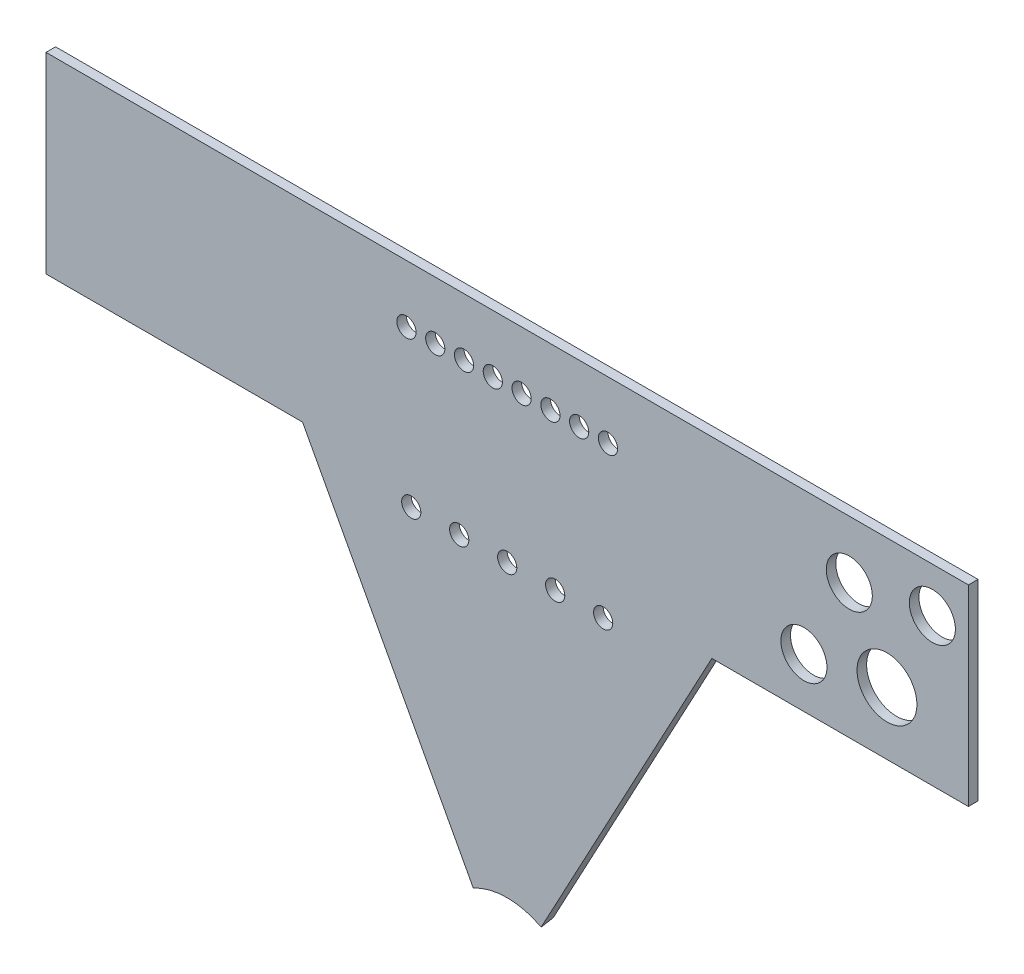
ISO-10303-21;
HEADER;
FILE_DESCRIPTION(('STEP AP214'),'2;1');
FILE_NAME('part.step','',(''),(''),'','','');
FILE_SCHEMA(('AUTOMOTIVE_DESIGN { 1 0 10303 214 1 1 1 1 }'));
ENDSEC;
DATA;
#1=APPLICATION_CONTEXT('core data for automotive mechanical design processes');
#2=APPLICATION_PROTOCOL_DEFINITION('international standard','automotive_design',2000,#1);
#3=PRODUCT_CONTEXT('',#1,'mechanical');
#4=PRODUCT('Part','Part','',(#3));
#5=PRODUCT_RELATED_PRODUCT_CATEGORY('part','',(#4));
#6=PRODUCT_DEFINITION_FORMATION('','',#4);
#7=PRODUCT_DEFINITION_CONTEXT('part definition',#1,'design');
#8=PRODUCT_DEFINITION('design','',#6,#7);
#9=PRODUCT_DEFINITION_SHAPE('','',#8);
#10=(LENGTH_UNIT() NAMED_UNIT(*) SI_UNIT(.MILLI.,.METRE.));
#11=(NAMED_UNIT(*) PLANE_ANGLE_UNIT() SI_UNIT($,.RADIAN.));
#12=(NAMED_UNIT(*) SI_UNIT($,.STERADIAN.) SOLID_ANGLE_UNIT());
#13=UNCERTAINTY_MEASURE_WITH_UNIT(LENGTH_MEASURE(1.E-05),#10,'distance_accuracy_value','');
#14=(GEOMETRIC_REPRESENTATION_CONTEXT(3) GLOBAL_UNCERTAINTY_ASSIGNED_CONTEXT((#13)) GLOBAL_UNIT_ASSIGNED_CONTEXT((#10,
#11,#12)) REPRESENTATION_CONTEXT('',''));
#15=CARTESIAN_POINT('',(0.,0.,0.));
#16=DIRECTION('',(0.,0.,1.));
#17=DIRECTION('',(1.,0.,0.));
#18=AXIS2_PLACEMENT_3D('',#15,#16,#17);
#19=CARTESIAN_POINT('',(0.,-189.675350303477,0.));
#20=DIRECTION('',(0.,0.,-1.));
#21=DIRECTION('',(-1.,0.,0.));
#22=AXIS2_PLACEMENT_3D('',#19,#20,#21);
#23=CONICAL_SURFACE('',#22,25.441249351152,0.488692190558413);
#24=DIRECTION('',(-0.221981139159225,0.413676107748804,-0.882947592858927));
#25=VECTOR('',#24,1.);
#26=CARTESIAN_POINT('',(0.,-189.675350303477,47.8480309661866));
#27=LINE('',#26,#25);
#28=CARTESIAN_POINT('',(-12.0294347097189,-167.257726229724,0.));
#29=VERTEX_POINT('',#28);
#30=CARTESIAN_POINT('',(-11.2312105313751,-168.745268245496,3.175));
#31=VERTEX_POINT('',#30);
#32=EDGE_CURVE('E254',#29,#31,#27,.F.);
#33=ORIENTED_EDGE('',*,*,#32,.F.);
#34=CARTESIAN_POINT('',(0.,-189.675350303477,0.));
#35=DIRECTION('',(0.,0.,-1.));
#36=DIRECTION('',(-1.,0.,0.));
#37=AXIS2_PLACEMENT_3D('',#34,#35,#36);
#38=CIRCLE('',#37,25.441249351152);
#39=CARTESIAN_POINT('',(12.0294347097191,-167.257726229724,0.));
#40=VERTEX_POINT('',#39);
#41=EDGE_CURVE('E113',#29,#40,#38,.T.);
#42=ORIENTED_EDGE('',*,*,#41,.T.);
#43=DIRECTION('',(0.221981139159225,0.413676107748804,-0.882947592858926));
#44=VECTOR('',#43,1.);
#45=CARTESIAN_POINT('',(1.710275213163E-13,-189.675350303477,47.8480309661866));
#46=LINE('',#45,#44);
#47=CARTESIAN_POINT('',(11.2312105313752,-168.745268245496,3.175));
#48=VERTEX_POINT('',#47);
#49=EDGE_CURVE('E245',#40,#48,#46,.F.);
#50=ORIENTED_EDGE('',*,*,#49,.T.);
#51=CARTESIAN_POINT('',(0.,-189.675350303477,3.175));
#52=DIRECTION('',(0.,0.,-1.));
#53=DIRECTION('',(-1.,0.,0.));
#54=AXIS2_PLACEMENT_3D('',#51,#52,#53);
#55=CIRCLE('',#54,23.7530719056268);
#56=EDGE_CURVE('E12',#31,#48,#55,.T.);
#57=ORIENTED_EDGE('',*,*,#56,.F.);
#58=EDGE_LOOP('',(#33,#42,#50,#57));
#59=FACE_BOUND('',#58,.T.);
#60=ADVANCED_FACE('F105',(#59),#23,.F.);
#61=CARTESIAN_POINT('',(0.,-189.675350303477,3.175));
#62=DIRECTION('',(0.,0.,-1.));
#63=DIRECTION('',(-1.,0.,0.));
#64=AXIS2_PLACEMENT_3D('',#61,#62,#63);
#65=PLANE('',#64);
#66=CARTESIAN_POINT('',(-31.75,-69.85,3.175));
#67=DIRECTION('',(0.,0.,1.));
#68=DIRECTION('',(1.,0.,0.));
#69=AXIS2_PLACEMENT_3D('',#66,#67,#68);
#70=CIRCLE('',#69,3.17499999999999);
#71=CARTESIAN_POINT('',(-28.575,-69.85,3.175));
#72=VERTEX_POINT('',#71);
#73=EDGE_CURVE('E617',#72,#72,#70,.T.);
#74=ORIENTED_EDGE('',*,*,#73,.F.);
#75=EDGE_LOOP('',(#74));
#76=FACE_BOUND('',#75,.T.);
#77=CARTESIAN_POINT('',(-15.875,-69.85,3.175));
#78=DIRECTION('',(0.,0.,1.));
#79=DIRECTION('',(1.,0.,0.));
#80=AXIS2_PLACEMENT_3D('',#77,#78,#79);
#81=CIRCLE('',#80,3.17499999999999);
#82=CARTESIAN_POINT('',(-12.7,-69.85,3.175));
#83=VERTEX_POINT('',#82);
#84=EDGE_CURVE('E621',#83,#83,#81,.T.);
#85=ORIENTED_EDGE('',*,*,#84,.F.);
#86=EDGE_LOOP('',(#85));
#87=FACE_BOUND('',#86,.T.);
#88=CARTESIAN_POINT('',(0.,-69.85,3.175));
#89=DIRECTION('',(0.,0.,1.));
#90=DIRECTION('',(1.,0.,0.));
#91=AXIS2_PLACEMENT_3D('',#88,#89,#90);
#92=CIRCLE('',#91,3.17499999999999);
#93=CARTESIAN_POINT('',(3.17499999999999,-69.85,3.175));
#94=VERTEX_POINT('',#93);
#95=EDGE_CURVE('E631',#94,#94,#92,.T.);
#96=ORIENTED_EDGE('',*,*,#95,.F.);
#97=EDGE_LOOP('',(#96));
#98=FACE_BOUND('',#97,.T.);
#99=CARTESIAN_POINT('',(15.875,-69.85,3.175));
#100=DIRECTION('',(0.,0.,1.));
#101=DIRECTION('',(1.,0.,0.));
#102=AXIS2_PLACEMENT_3D('',#99,#100,#101);
#103=CIRCLE('',#102,3.17499999999999);
#104=CARTESIAN_POINT('',(19.05,-69.85,3.175));
#105=VERTEX_POINT('',#104);
#106=EDGE_CURVE('E639',#105,#105,#103,.T.);
#107=ORIENTED_EDGE('',*,*,#106,.F.);
#108=EDGE_LOOP('',(#107));
#109=FACE_BOUND('',#108,.T.);
#110=CARTESIAN_POINT('',(31.75,-69.85,3.175));
#111=DIRECTION('',(0.,0.,1.));
#112=DIRECTION('',(1.,0.,0.));
#113=AXIS2_PLACEMENT_3D('',#110,#111,#112);
#114=CIRCLE('',#113,3.17499999999998);
#115=CARTESIAN_POINT('',(34.925,-69.85,3.175));
#116=VERTEX_POINT('',#115);
#117=EDGE_CURVE('E647',#116,#116,#114,.T.);
#118=ORIENTED_EDGE('',*,*,#117,.F.);
#119=EDGE_LOOP('',(#118));
#120=FACE_BOUND('',#119,.T.);
#121=CARTESIAN_POINT('',(98.1656068778571,-47.0265963737712,3.175));
#122=DIRECTION('',(0.,0.,1.));
#123=DIRECTION('',(1.,0.,0.));
#124=AXIS2_PLACEMENT_3D('',#121,#122,#123);
#125=CIRCLE('',#124,7.62);
#126=CARTESIAN_POINT('',(105.785606877857,-47.0265963737712,3.175));
#127=VERTEX_POINT('',#126);
#128=EDGE_CURVE('E673',#127,#127,#125,.T.);
#129=ORIENTED_EDGE('',*,*,#128,.F.);
#130=EDGE_LOOP('',(#129));
#131=FACE_BOUND('',#130,.T.);
#132=CARTESIAN_POINT('',(113.178020252764,-19.05,3.175));
#133=DIRECTION('',(0.,0.,1.));
#134=DIRECTION('',(1.,0.,0.));
#135=AXIS2_PLACEMENT_3D('',#132,#133,#134);
#136=CIRCLE('',#135,7.62);
#137=CARTESIAN_POINT('',(120.798020252764,-19.05,3.175));
#138=VERTEX_POINT('',#137);
#139=EDGE_CURVE('E665',#138,#138,#136,.T.);
#140=ORIENTED_EDGE('',*,*,#139,.F.);
#141=EDGE_LOOP('',(#140));
#142=FACE_BOUND('',#141,.T.);
#143=CARTESIAN_POINT('',(140.652136328267,-14.8542384926758,3.175));
#144=DIRECTION('',(0.,0.,1.));
#145=DIRECTION('',(1.,0.,0.));
#146=AXIS2_PLACEMENT_3D('',#143,#144,#145);
#147=CIRCLE('',#146,7.62);
#148=CARTESIAN_POINT('',(148.272136328267,-14.8542384926758,3.175));
#149=VERTEX_POINT('',#148);
#150=EDGE_CURVE('E656',#149,#149,#147,.T.);
#151=ORIENTED_EDGE('',*,*,#150,.F.);
#152=EDGE_LOOP('',(#151));
#153=FACE_BOUND('',#152,.T.);
#154=CARTESIAN_POINT('',(125.63972295336,-42.8308348664471,3.175));
#155=DIRECTION('',(0.,0.,1.));
#156=DIRECTION('',(1.,0.,0.));
#157=AXIS2_PLACEMENT_3D('',#154,#155,#156);
#158=CIRCLE('',#157,9.90600000000007);
#159=CARTESIAN_POINT('',(135.54572295336,-42.8308348664471,3.175));
#160=VERTEX_POINT('',#159);
#161=EDGE_CURVE('E660',#160,#160,#158,.T.);
#162=ORIENTED_EDGE('',*,*,#161,.F.);
#163=EDGE_LOOP('',(#162));
#164=FACE_BOUND('',#163,.T.);
#165=CARTESIAN_POINT('',(33.3374999999998,-19.0500000000003,3.175));
#166=DIRECTION('',(0.,0.,1.));
#167=DIRECTION('',(1.,0.,0.));
#168=AXIS2_PLACEMENT_3D('',#165,#166,#167);
#169=CIRCLE('',#168,3.175);
#170=CARTESIAN_POINT('',(36.5124999999998,-19.0500000000003,3.175));
#171=VERTEX_POINT('',#170);
#172=EDGE_CURVE('E684',#171,#171,#169,.T.);
#173=ORIENTED_EDGE('',*,*,#172,.F.);
#174=EDGE_LOOP('',(#173));
#175=FACE_BOUND('',#174,.T.);
#176=CARTESIAN_POINT('',(23.8124999999998,-19.0500000000002,3.175));
#177=DIRECTION('',(0.,0.,1.));
#178=DIRECTION('',(1.,0.,0.));
#179=AXIS2_PLACEMENT_3D('',#176,#177,#178);
#180=CIRCLE('',#179,3.175);
#181=CARTESIAN_POINT('',(26.9874999999998,-19.0500000000002,3.175));
#182=VERTEX_POINT('',#181);
#183=EDGE_CURVE('E695',#182,#182,#180,.T.);
#184=ORIENTED_EDGE('',*,*,#183,.F.);
#185=EDGE_LOOP('',(#184));
#186=FACE_BOUND('',#185,.T.);
#187=CARTESIAN_POINT('',(14.2874999999998,-19.0500000000001,3.175));
#188=DIRECTION('',(0.,0.,1.));
#189=DIRECTION('',(1.,0.,0.));
#190=AXIS2_PLACEMENT_3D('',#187,#188,#189);
#191=CIRCLE('',#190,3.175);
#192=CARTESIAN_POINT('',(17.4624999999998,-19.0500000000001,3.175));
#193=VERTEX_POINT('',#192);
#194=EDGE_CURVE('E703',#193,#193,#191,.T.);
#195=ORIENTED_EDGE('',*,*,#194,.F.);
#196=EDGE_LOOP('',(#195));
#197=FACE_BOUND('',#196,.T.);
#198=CARTESIAN_POINT('',(4.76249999999985,-19.05,3.175));
#199=DIRECTION('',(0.,0.,1.));
#200=DIRECTION('',(1.,0.,0.));
#201=AXIS2_PLACEMENT_3D('',#198,#199,#200);
#202=CIRCLE('',#201,3.175);
#203=CARTESIAN_POINT('',(7.93749999999985,-19.05,3.175));
#204=VERTEX_POINT('',#203);
#205=EDGE_CURVE('E711',#204,#204,#202,.T.);
#206=ORIENTED_EDGE('',*,*,#205,.F.);
#207=EDGE_LOOP('',(#206));
#208=FACE_BOUND('',#207,.T.);
#209=CARTESIAN_POINT('',(-33.3375,-19.05,3.175));
#210=DIRECTION('',(0.,0.,1.));
#211=DIRECTION('',(1.,0.,0.));
#212=AXIS2_PLACEMENT_3D('',#209,#210,#211);
#213=CIRCLE('',#212,3.175);
#214=CARTESIAN_POINT('',(-30.1625,-19.05,3.175));
#215=VERTEX_POINT('',#214);
#216=EDGE_CURVE('E719',#215,#215,#213,.T.);
#217=ORIENTED_EDGE('',*,*,#216,.F.);
#218=EDGE_LOOP('',(#217));
#219=FACE_BOUND('',#218,.T.);
#220=CARTESIAN_POINT('',(-23.8125,-19.05,3.175));
#221=DIRECTION('',(0.,0.,1.));
#222=DIRECTION('',(1.,0.,0.));
#223=AXIS2_PLACEMENT_3D('',#220,#221,#222);
#224=CIRCLE('',#223,3.175);
#225=CARTESIAN_POINT('',(-20.6375,-19.05,3.175));
#226=VERTEX_POINT('',#225);
#227=EDGE_CURVE('E727',#226,#226,#224,.T.);
#228=ORIENTED_EDGE('',*,*,#227,.F.);
#229=EDGE_LOOP('',(#228));
#230=FACE_BOUND('',#229,.T.);
#231=CARTESIAN_POINT('',(-14.2875,-19.05,3.175));
#232=DIRECTION('',(0.,0.,1.));
#233=DIRECTION('',(1.,0.,0.));
#234=AXIS2_PLACEMENT_3D('',#231,#232,#233);
#235=CIRCLE('',#234,3.175);
#236=CARTESIAN_POINT('',(-11.1125,-19.05,3.175));
#237=VERTEX_POINT('',#236);
#238=EDGE_CURVE('E735',#237,#237,#235,.T.);
#239=ORIENTED_EDGE('',*,*,#238,.F.);
#240=EDGE_LOOP('',(#239));
#241=FACE_BOUND('',#240,.T.);
#242=CARTESIAN_POINT('',(-4.7625,-19.05,3.175));
#243=DIRECTION('',(0.,0.,1.));
#244=DIRECTION('',(1.,0.,0.));
#245=AXIS2_PLACEMENT_3D('',#242,#243,#244);
#246=CIRCLE('',#245,3.175);
#247=CARTESIAN_POINT('',(-1.5875,-19.05,3.175));
#248=VERTEX_POINT('',#247);
#249=EDGE_CURVE('E203',#248,#248,#246,.T.);
#250=ORIENTED_EDGE('',*,*,#249,.F.);
#251=EDGE_LOOP('',(#250));
#252=FACE_BOUND('',#251,.T.);
#253=DIRECTION('',(1.,0.,0.));
#254=VECTOR('',#253,1.);
#255=CARTESIAN_POINT('',(101.780957474,0.,3.175));
#256=LINE('',#255,#254);
#257=CARTESIAN_POINT('',(-152.580957474,0.,3.175));
#258=VERTEX_POINT('',#257);
#259=CARTESIAN_POINT('',(152.580957474,0.,3.175));
#260=VERTEX_POINT('',#259);
#261=EDGE_CURVE('E197',#258,#260,#256,.T.);
#262=ORIENTED_EDGE('',*,*,#261,.F.);
#263=DIRECTION('',(0.,-1.,0.));
#264=VECTOR('',#263,1.);
#265=CARTESIAN_POINT('',(-152.580957474,0.,3.175));
#266=LINE('',#265,#264);
#267=CARTESIAN_POINT('',(-152.580957474,-63.5,3.175));
#268=VERTEX_POINT('',#267);
#269=EDGE_CURVE('E218',#258,#268,#266,.T.);
#270=ORIENTED_EDGE('',*,*,#269,.T.);
#271=DIRECTION('',(1.,0.,0.));
#272=VECTOR('',#271,1.);
#273=CARTESIAN_POINT('',(-152.580957474,-63.5,3.175));
#274=LINE('',#273,#272);
#275=CARTESIAN_POINT('',(-67.7064676193184,-63.5,3.175));
#276=VERTEX_POINT('',#275);
#277=EDGE_CURVE('E221',#268,#276,#274,.T.);
#278=ORIENTED_EDGE('',*,*,#277,.T.);
#279=DIRECTION('',(0.472831917319904,-0.881152641693585,0.));
#280=VECTOR('',#279,1.);
#281=CARTESIAN_POINT('',(-79.0257865686502,-42.4057222471134,3.175));
#282=LINE('',#281,#280);
#283=EDGE_CURVE('E242',#276,#31,#282,.T.);
#284=ORIENTED_EDGE('',*,*,#283,.T.);
#285=ORIENTED_EDGE('',*,*,#56,.T.);
#286=DIRECTION('',(-0.472831917319904,-0.881152641693585,0.));
#287=VECTOR('',#286,1.);
#288=CARTESIAN_POINT('',(79.0257865686503,-42.4057222471134,3.175));
#289=LINE('',#288,#287);
#290=CARTESIAN_POINT('',(67.7064676193185,-63.5,3.175));
#291=VERTEX_POINT('',#290);
#292=EDGE_CURVE('E246',#291,#48,#289,.T.);
#293=ORIENTED_EDGE('',*,*,#292,.F.);
#294=DIRECTION('',(1.,0.,0.));
#295=VECTOR('',#294,1.);
#296=CARTESIAN_POINT('',(152.580957474,-63.5,3.175));
#297=LINE('',#296,#295);
#298=CARTESIAN_POINT('',(152.580957474,-63.5,3.175));
#299=VERTEX_POINT('',#298);
#300=EDGE_CURVE('E120',#291,#299,#297,.T.);
#301=ORIENTED_EDGE('',*,*,#300,.T.);
#302=DIRECTION('',(0.,1.,0.));
#303=VECTOR('',#302,1.);
#304=CARTESIAN_POINT('',(152.580957474,0.,3.175));
#305=LINE('',#304,#303);
#306=EDGE_CURVE('E215',#299,#260,#305,.T.);
#307=ORIENTED_EDGE('',*,*,#306,.T.);
#308=EDGE_LOOP('',(#262,#270,#278,#284,#285,#293,#301,#307));
#309=FACE_BOUND('',#308,.T.);
#310=ADVANCED_FACE('F272',(#76,#87,#98,#109,#120,#131,#142,#153,#164,#175,#186,#197,#208,#219,
#230,#241,#252,#309),#65,.F.);
#311=CARTESIAN_POINT('',(0.,-189.675350303477,0.));
#312=DIRECTION('',(0.,0.,-1.));
#313=DIRECTION('',(-1.,0.,0.));
#314=AXIS2_PLACEMENT_3D('',#311,#312,#313);
#315=PLANE('',#314);
#316=CARTESIAN_POINT('',(-31.75,-69.85,0.));
#317=DIRECTION('',(0.,0.,1.));
#318=DIRECTION('',(1.,0.,0.));
#319=AXIS2_PLACEMENT_3D('',#316,#317,#318);
#320=CIRCLE('',#319,3.175);
#321=CARTESIAN_POINT('',(-28.575,-69.85,0.));
#322=VERTEX_POINT('',#321);
#323=EDGE_CURVE('E615',#322,#322,#320,.T.);
#324=ORIENTED_EDGE('',*,*,#323,.T.);
#325=EDGE_LOOP('',(#324));
#326=FACE_BOUND('',#325,.T.);
#327=CARTESIAN_POINT('',(-15.875,-69.85,0.));
#328=DIRECTION('',(0.,0.,1.));
#329=DIRECTION('',(1.,0.,0.));
#330=AXIS2_PLACEMENT_3D('',#327,#328,#329);
#331=CIRCLE('',#330,3.175);
#332=CARTESIAN_POINT('',(-12.7,-69.85,0.));
#333=VERTEX_POINT('',#332);
#334=EDGE_CURVE('E627',#333,#333,#331,.T.);
#335=ORIENTED_EDGE('',*,*,#334,.T.);
#336=EDGE_LOOP('',(#335));
#337=FACE_BOUND('',#336,.T.);
#338=CARTESIAN_POINT('',(0.,-69.85,0.));
#339=DIRECTION('',(0.,0.,1.));
#340=DIRECTION('',(1.,0.,0.));
#341=AXIS2_PLACEMENT_3D('',#338,#339,#340);
#342=CIRCLE('',#341,3.175);
#343=CARTESIAN_POINT('',(3.175,-69.85,0.));
#344=VERTEX_POINT('',#343);
#345=EDGE_CURVE('E635',#344,#344,#342,.T.);
#346=ORIENTED_EDGE('',*,*,#345,.T.);
#347=EDGE_LOOP('',(#346));
#348=FACE_BOUND('',#347,.T.);
#349=CARTESIAN_POINT('',(15.875,-69.85,0.));
#350=DIRECTION('',(0.,0.,1.));
#351=DIRECTION('',(1.,0.,0.));
#352=AXIS2_PLACEMENT_3D('',#349,#350,#351);
#353=CIRCLE('',#352,3.175);
#354=CARTESIAN_POINT('',(19.05,-69.85,0.));
#355=VERTEX_POINT('',#354);
#356=EDGE_CURVE('E643',#355,#355,#353,.T.);
#357=ORIENTED_EDGE('',*,*,#356,.T.);
#358=EDGE_LOOP('',(#357));
#359=FACE_BOUND('',#358,.T.);
#360=CARTESIAN_POINT('',(31.75,-69.85,0.));
#361=DIRECTION('',(0.,0.,1.));
#362=DIRECTION('',(1.,0.,0.));
#363=AXIS2_PLACEMENT_3D('',#360,#361,#362);
#364=CIRCLE('',#363,3.175);
#365=CARTESIAN_POINT('',(34.925,-69.85,0.));
#366=VERTEX_POINT('',#365);
#367=EDGE_CURVE('E651',#366,#366,#364,.T.);
#368=ORIENTED_EDGE('',*,*,#367,.T.);
#369=EDGE_LOOP('',(#368));
#370=FACE_BOUND('',#369,.T.);
#371=CARTESIAN_POINT('',(98.1656068778571,-47.0265963737712,0.));
#372=DIRECTION('',(0.,0.,1.));
#373=DIRECTION('',(1.,0.,0.));
#374=AXIS2_PLACEMENT_3D('',#371,#372,#373);
#375=CIRCLE('',#374,7.62);
#376=CARTESIAN_POINT('',(105.785606877857,-47.0265963737712,0.));
#377=VERTEX_POINT('',#376);
#378=EDGE_CURVE('E655',#377,#377,#375,.T.);
#379=ORIENTED_EDGE('',*,*,#378,.T.);
#380=EDGE_LOOP('',(#379));
#381=FACE_BOUND('',#380,.T.);
#382=CARTESIAN_POINT('',(113.178020252764,-19.05,0.));
#383=DIRECTION('',(0.,0.,1.));
#384=DIRECTION('',(1.,0.,0.));
#385=AXIS2_PLACEMENT_3D('',#382,#383,#384);
#386=CIRCLE('',#385,7.62);
#387=CARTESIAN_POINT('',(120.798020252764,-19.05,0.));
#388=VERTEX_POINT('',#387);
#389=EDGE_CURVE('E669',#388,#388,#386,.T.);
#390=ORIENTED_EDGE('',*,*,#389,.T.);
#391=EDGE_LOOP('',(#390));
#392=FACE_BOUND('',#391,.T.);
#393=CARTESIAN_POINT('',(140.652136328267,-14.8542384926758,0.));
#394=DIRECTION('',(0.,0.,1.));
#395=DIRECTION('',(1.,0.,0.));
#396=AXIS2_PLACEMENT_3D('',#393,#394,#395);
#397=CIRCLE('',#396,7.62);
#398=CARTESIAN_POINT('',(148.272136328267,-14.8542384926758,0.));
#399=VERTEX_POINT('',#398);
#400=EDGE_CURVE('E661',#399,#399,#397,.T.);
#401=ORIENTED_EDGE('',*,*,#400,.T.);
#402=EDGE_LOOP('',(#401));
#403=FACE_BOUND('',#402,.T.);
#404=CARTESIAN_POINT('',(125.63972295336,-42.8308348664471,0.));
#405=DIRECTION('',(0.,0.,1.));
#406=DIRECTION('',(1.,0.,0.));
#407=AXIS2_PLACEMENT_3D('',#404,#405,#406);
#408=CIRCLE('',#407,9.90600000000007);
#409=CARTESIAN_POINT('',(135.54572295336,-42.8308348664471,0.));
#410=VERTEX_POINT('',#409);
#411=EDGE_CURVE('E680',#410,#410,#408,.T.);
#412=ORIENTED_EDGE('',*,*,#411,.T.);
#413=EDGE_LOOP('',(#412));
#414=FACE_BOUND('',#413,.T.);
#415=CARTESIAN_POINT('',(33.3374999999998,-19.0500000000003,0.));
#416=DIRECTION('',(0.,0.,1.));
#417=DIRECTION('',(1.,0.,0.));
#418=AXIS2_PLACEMENT_3D('',#415,#416,#417);
#419=CIRCLE('',#418,3.175);
#420=CARTESIAN_POINT('',(36.5124999999998,-19.0500000000003,0.));
#421=VERTEX_POINT('',#420);
#422=EDGE_CURVE('E691',#421,#421,#419,.T.);
#423=ORIENTED_EDGE('',*,*,#422,.T.);
#424=EDGE_LOOP('',(#423));
#425=FACE_BOUND('',#424,.T.);
#426=CARTESIAN_POINT('',(23.8124999999998,-19.0500000000002,0.));
#427=DIRECTION('',(0.,0.,1.));
#428=DIRECTION('',(1.,0.,0.));
#429=AXIS2_PLACEMENT_3D('',#426,#427,#428);
#430=CIRCLE('',#429,3.175);
#431=CARTESIAN_POINT('',(26.9874999999998,-19.0500000000002,0.));
#432=VERTEX_POINT('',#431);
#433=EDGE_CURVE('E699',#432,#432,#430,.T.);
#434=ORIENTED_EDGE('',*,*,#433,.T.);
#435=EDGE_LOOP('',(#434));
#436=FACE_BOUND('',#435,.T.);
#437=CARTESIAN_POINT('',(14.2874999999998,-19.0500000000001,0.));
#438=DIRECTION('',(0.,0.,1.));
#439=DIRECTION('',(1.,0.,0.));
#440=AXIS2_PLACEMENT_3D('',#437,#438,#439);
#441=CIRCLE('',#440,3.175);
#442=CARTESIAN_POINT('',(17.4624999999998,-19.0500000000001,0.));
#443=VERTEX_POINT('',#442);
#444=EDGE_CURVE('E707',#443,#443,#441,.T.);
#445=ORIENTED_EDGE('',*,*,#444,.T.);
#446=EDGE_LOOP('',(#445));
#447=FACE_BOUND('',#446,.T.);
#448=CARTESIAN_POINT('',(4.76249999999985,-19.05,0.));
#449=DIRECTION('',(0.,0.,1.));
#450=DIRECTION('',(1.,0.,0.));
#451=AXIS2_PLACEMENT_3D('',#448,#449,#450);
#452=CIRCLE('',#451,3.175);
#453=CARTESIAN_POINT('',(7.93749999999985,-19.05,0.));
#454=VERTEX_POINT('',#453);
#455=EDGE_CURVE('E715',#454,#454,#452,.T.);
#456=ORIENTED_EDGE('',*,*,#455,.T.);
#457=EDGE_LOOP('',(#456));
#458=FACE_BOUND('',#457,.T.);
#459=CARTESIAN_POINT('',(-33.3375,-19.05,0.));
#460=DIRECTION('',(0.,0.,1.));
#461=DIRECTION('',(1.,0.,0.));
#462=AXIS2_PLACEMENT_3D('',#459,#460,#461);
#463=CIRCLE('',#462,3.175);
#464=CARTESIAN_POINT('',(-30.1625,-19.05,0.));
#465=VERTEX_POINT('',#464);
#466=EDGE_CURVE('E723',#465,#465,#463,.T.);
#467=ORIENTED_EDGE('',*,*,#466,.T.);
#468=EDGE_LOOP('',(#467));
#469=FACE_BOUND('',#468,.T.);
#470=CARTESIAN_POINT('',(-23.8125,-19.05,0.));
#471=DIRECTION('',(0.,0.,1.));
#472=DIRECTION('',(1.,0.,0.));
#473=AXIS2_PLACEMENT_3D('',#470,#471,#472);
#474=CIRCLE('',#473,3.175);
#475=CARTESIAN_POINT('',(-20.6375,-19.05,0.));
#476=VERTEX_POINT('',#475);
#477=EDGE_CURVE('E731',#476,#476,#474,.T.);
#478=ORIENTED_EDGE('',*,*,#477,.T.);
#479=EDGE_LOOP('',(#478));
#480=FACE_BOUND('',#479,.T.);
#481=CARTESIAN_POINT('',(-14.2875,-19.05,0.));
#482=DIRECTION('',(0.,0.,1.));
#483=DIRECTION('',(1.,0.,0.));
#484=AXIS2_PLACEMENT_3D('',#481,#482,#483);
#485=CIRCLE('',#484,3.175);
#486=CARTESIAN_POINT('',(-11.1125,-19.05,0.));
#487=VERTEX_POINT('',#486);
#488=EDGE_CURVE('E739',#487,#487,#485,.T.);
#489=ORIENTED_EDGE('',*,*,#488,.T.);
#490=EDGE_LOOP('',(#489));
#491=FACE_BOUND('',#490,.T.);
#492=CARTESIAN_POINT('',(-4.7625,-19.05,0.));
#493=DIRECTION('',(0.,0.,1.));
#494=DIRECTION('',(1.,0.,0.));
#495=AXIS2_PLACEMENT_3D('',#492,#493,#494);
#496=CIRCLE('',#495,3.175);
#497=CARTESIAN_POINT('',(-1.5875,-19.05,0.));
#498=VERTEX_POINT('',#497);
#499=EDGE_CURVE('E199',#498,#498,#496,.T.);
#500=ORIENTED_EDGE('',*,*,#499,.T.);
#501=EDGE_LOOP('',(#500));
#502=FACE_BOUND('',#501,.T.);
#503=DIRECTION('',(0.472831917319911,0.881152641693581,0.));
#504=VECTOR('',#503,1.);
#505=CARTESIAN_POINT('',(101.780957474,0.,0.));
#506=LINE('',#505,#504);
#507=CARTESIAN_POINT('',(67.7064676193184,-63.5,0.));
#508=VERTEX_POINT('',#507);
#509=EDGE_CURVE('E184',#40,#508,#506,.T.);
#510=ORIENTED_EDGE('',*,*,#509,.F.);
#511=ORIENTED_EDGE('',*,*,#41,.F.);
#512=DIRECTION('',(0.472831917319904,-0.881152641693585,0.));
#513=VECTOR('',#512,1.);
#514=CARTESIAN_POINT('',(-101.780957474,0.,0.));
#515=LINE('',#514,#513);
#516=CARTESIAN_POINT('',(-67.7064676193184,-63.5,0.));
#517=VERTEX_POINT('',#516);
#518=EDGE_CURVE('E183',#517,#29,#515,.T.);
#519=ORIENTED_EDGE('',*,*,#518,.F.);
#520=DIRECTION('',(1.,0.,0.));
#521=VECTOR('',#520,1.);
#522=CARTESIAN_POINT('',(-152.580957474,-63.5,0.));
#523=LINE('',#522,#521);
#524=CARTESIAN_POINT('',(-152.580957474,-63.5,0.));
#525=VERTEX_POINT('',#524);
#526=EDGE_CURVE('E229',#525,#517,#523,.T.);
#527=ORIENTED_EDGE('',*,*,#526,.F.);
#528=DIRECTION('',(0.,-1.,0.));
#529=VECTOR('',#528,1.);
#530=CARTESIAN_POINT('',(-152.580957474,0.,0.));
#531=LINE('',#530,#529);
#532=CARTESIAN_POINT('',(-152.580957474,0.,0.));
#533=VERTEX_POINT('',#532);
#534=EDGE_CURVE('E177',#533,#525,#531,.T.);
#535=ORIENTED_EDGE('',*,*,#534,.F.);
#536=DIRECTION('',(-1.,0.,0.));
#537=VECTOR('',#536,1.);
#538=CARTESIAN_POINT('',(-101.780957474,0.,0.));
#539=LINE('',#538,#537);
#540=CARTESIAN_POINT('',(152.580957474,0.,0.));
#541=VERTEX_POINT('',#540);
#542=EDGE_CURVE('E170',#541,#533,#539,.T.);
#543=ORIENTED_EDGE('',*,*,#542,.F.);
#544=DIRECTION('',(0.,1.,0.));
#545=VECTOR('',#544,1.);
#546=CARTESIAN_POINT('',(152.580957474,0.,0.));
#547=LINE('',#546,#545);
#548=CARTESIAN_POINT('',(152.580957474,-63.5,0.));
#549=VERTEX_POINT('',#548);
#550=EDGE_CURVE('E174',#549,#541,#547,.T.);
#551=ORIENTED_EDGE('',*,*,#550,.F.);
#552=DIRECTION('',(1.,0.,0.));
#553=VECTOR('',#552,1.);
#554=CARTESIAN_POINT('',(152.580957474,-63.5,0.));
#555=LINE('',#554,#553);
#556=EDGE_CURVE('E210',#508,#549,#555,.T.);
#557=ORIENTED_EDGE('',*,*,#556,.F.);
#558=EDGE_LOOP('',(#510,#511,#519,#527,#535,#543,#551,#557));
#559=FACE_BOUND('',#558,.T.);
#560=ADVANCED_FACE('F173',(#326,#337,#348,#359,#370,#381,#392,#403,#414,#425,#436,#447,#458,
#469,#480,#491,#502,#559),#315,.T.);
#561=CARTESIAN_POINT('',(-79.0257865686502,-42.4057222471134,0.));
#562=DIRECTION('',(-0.881152641693585,-0.472831917319904,0.));
#563=DIRECTION('',(0.472831917319904,-0.881152641693585,0.));
#564=AXIS2_PLACEMENT_3D('',#561,#562,#563);
#565=PLANE('',#564);
#566=DIRECTION('',(0.,0.,1.));
#567=VECTOR('',#566,1.);
#568=CARTESIAN_POINT('',(-67.7064676193184,-63.5,-105.999665226323));
#569=LINE('',#568,#567);
#570=EDGE_CURVE('E128',#517,#276,#569,.T.);
#571=ORIENTED_EDGE('',*,*,#570,.F.);
#572=ORIENTED_EDGE('',*,*,#518,.T.);
#573=ORIENTED_EDGE('',*,*,#32,.T.);
#574=ORIENTED_EDGE('',*,*,#283,.F.);
#575=EDGE_LOOP('',(#571,#572,#573,#574));
#576=FACE_BOUND('',#575,.T.);
#577=ADVANCED_FACE('F274',(#576),#565,.T.);
#578=CARTESIAN_POINT('',(79.0257865686503,-42.4057222471134,0.));
#579=DIRECTION('',(-0.881152641693585,0.472831917319903,0.));
#580=DIRECTION('',(-0.472831917319903,-0.881152641693585,0.));
#581=AXIS2_PLACEMENT_3D('',#578,#579,#580);
#582=PLANE('',#581);
#583=ORIENTED_EDGE('',*,*,#509,.T.);
#584=DIRECTION('',(0.,0.,1.));
#585=VECTOR('',#584,1.);
#586=CARTESIAN_POINT('',(67.7064676193184,-63.5,-105.999665226323));
#587=LINE('',#586,#585);
#588=EDGE_CURVE('E207',#508,#291,#587,.T.);
#589=ORIENTED_EDGE('',*,*,#588,.T.);
#590=ORIENTED_EDGE('',*,*,#292,.T.);
#591=ORIENTED_EDGE('',*,*,#49,.F.);
#592=EDGE_LOOP('',(#583,#589,#590,#591));
#593=FACE_BOUND('',#592,.T.);
#594=ADVANCED_FACE('F269',(#593),#582,.F.);
#595=CARTESIAN_POINT('',(101.780957474,0.,0.));
#596=DIRECTION('',(0.,-1.,0.));
#597=DIRECTION('',(1.,0.,0.));
#598=AXIS2_PLACEMENT_3D('',#595,#596,#597);
#599=PLANE('',#598);
#600=ORIENTED_EDGE('',*,*,#542,.T.);
#601=DIRECTION('',(0.,0.,1.));
#602=VECTOR('',#601,1.);
#603=CARTESIAN_POINT('',(-152.580957474,0.,-105.999665226323));
#604=LINE('',#603,#602);
#605=EDGE_CURVE('E225',#533,#258,#604,.T.);
#606=ORIENTED_EDGE('',*,*,#605,.T.);
#607=ORIENTED_EDGE('',*,*,#261,.T.);
#608=DIRECTION('',(0.,0.,1.));
#609=VECTOR('',#608,1.);
#610=CARTESIAN_POINT('',(152.580957474,0.,-105.999665226323));
#611=LINE('',#610,#609);
#612=EDGE_CURVE('E190',#541,#260,#611,.T.);
#613=ORIENTED_EDGE('',*,*,#612,.F.);
#614=EDGE_LOOP('',(#600,#606,#607,#613));
#615=FACE_BOUND('',#614,.T.);
#616=ADVANCED_FACE('F196',(#615),#599,.F.);
#617=CARTESIAN_POINT('',(-152.580957474,0.,-105.999665226323));
#618=DIRECTION('',(-1.,0.,0.));
#619=DIRECTION('',(0.,0.,1.));
#620=AXIS2_PLACEMENT_3D('',#617,#618,#619);
#621=PLANE('',#620);
#622=ORIENTED_EDGE('',*,*,#605,.F.);
#623=ORIENTED_EDGE('',*,*,#534,.T.);
#624=DIRECTION('',(0.,0.,1.));
#625=VECTOR('',#624,1.);
#626=CARTESIAN_POINT('',(-152.580957474,-63.5,-105.999665226323));
#627=LINE('',#626,#625);
#628=EDGE_CURVE('E233',#525,#268,#627,.T.);
#629=ORIENTED_EDGE('',*,*,#628,.T.);
#630=ORIENTED_EDGE('',*,*,#269,.F.);
#631=EDGE_LOOP('',(#622,#623,#629,#630));
#632=FACE_BOUND('',#631,.T.);
#633=ADVANCED_FACE('F280',(#632),#621,.T.);
#634=CARTESIAN_POINT('',(-152.580957474,-63.5,-105.999665226323));
#635=DIRECTION('',(0.,-1.,0.));
#636=DIRECTION('',(0.,0.,-1.));
#637=AXIS2_PLACEMENT_3D('',#634,#635,#636);
#638=PLANE('',#637);
#639=ORIENTED_EDGE('',*,*,#628,.F.);
#640=ORIENTED_EDGE('',*,*,#526,.T.);
#641=ORIENTED_EDGE('',*,*,#570,.T.);
#642=ORIENTED_EDGE('',*,*,#277,.F.);
#643=EDGE_LOOP('',(#639,#640,#641,#642));
#644=FACE_BOUND('',#643,.T.);
#645=ADVANCED_FACE('F277',(#644),#638,.T.);
#646=CARTESIAN_POINT('',(152.580957474,-63.5,-105.999665226323));
#647=DIRECTION('',(0.,-1.,0.));
#648=DIRECTION('',(0.,0.,-1.));
#649=AXIS2_PLACEMENT_3D('',#646,#647,#648);
#650=PLANE('',#649);
#651=ORIENTED_EDGE('',*,*,#588,.F.);
#652=ORIENTED_EDGE('',*,*,#556,.T.);
#653=DIRECTION('',(0.,0.,1.));
#654=VECTOR('',#653,1.);
#655=CARTESIAN_POINT('',(152.580957474,-63.5,-105.999665226323));
#656=LINE('',#655,#654);
#657=EDGE_CURVE('E192',#549,#299,#656,.T.);
#658=ORIENTED_EDGE('',*,*,#657,.T.);
#659=ORIENTED_EDGE('',*,*,#300,.F.);
#660=EDGE_LOOP('',(#651,#652,#658,#659));
#661=FACE_BOUND('',#660,.T.);
#662=ADVANCED_FACE('F287',(#661),#650,.T.);
#663=CARTESIAN_POINT('',(152.580957474,0.,-105.999665226323));
#664=DIRECTION('',(1.,0.,0.));
#665=DIRECTION('',(0.,0.,-1.));
#666=AXIS2_PLACEMENT_3D('',#663,#664,#665);
#667=PLANE('',#666);
#668=ORIENTED_EDGE('',*,*,#657,.F.);
#669=ORIENTED_EDGE('',*,*,#550,.T.);
#670=ORIENTED_EDGE('',*,*,#612,.T.);
#671=ORIENTED_EDGE('',*,*,#306,.F.);
#672=EDGE_LOOP('',(#668,#669,#670,#671));
#673=FACE_BOUND('',#672,.T.);
#674=ADVANCED_FACE('F188',(#673),#667,.T.);
#675=CARTESIAN_POINT('',(-4.7625,-19.05,3.175));
#676=DIRECTION('',(0.,0.,1.));
#677=DIRECTION('',(1.,0.,0.));
#678=AXIS2_PLACEMENT_3D('',#675,#676,#677);
#679=CYLINDRICAL_SURFACE('',#678,3.175);
#680=ORIENTED_EDGE('',*,*,#499,.F.);
#681=EDGE_LOOP('',(#680));
#682=FACE_BOUND('',#681,.T.);
#683=ORIENTED_EDGE('',*,*,#249,.T.);
#684=EDGE_LOOP('',(#683));
#685=FACE_BOUND('',#684,.T.);
#686=ADVANCED_FACE('F349',(#682,#685),#679,.F.);
#687=CARTESIAN_POINT('',(-14.2875,-19.05,3.175));
#688=DIRECTION('',(0.,0.,1.));
#689=DIRECTION('',(1.,0.,0.));
#690=AXIS2_PLACEMENT_3D('',#687,#688,#689);
#691=CYLINDRICAL_SURFACE('',#690,3.175);
#692=ORIENTED_EDGE('',*,*,#488,.F.);
#693=EDGE_LOOP('',(#692));
#694=FACE_BOUND('',#693,.T.);
#695=ORIENTED_EDGE('',*,*,#238,.T.);
#696=EDGE_LOOP('',(#695));
#697=FACE_BOUND('',#696,.T.);
#698=ADVANCED_FACE('F359',(#694,#697),#691,.F.);
#699=CARTESIAN_POINT('',(-23.8125,-19.05,3.175));
#700=DIRECTION('',(0.,0.,1.));
#701=DIRECTION('',(1.,0.,0.));
#702=AXIS2_PLACEMENT_3D('',#699,#700,#701);
#703=CYLINDRICAL_SURFACE('',#702,3.175);
#704=ORIENTED_EDGE('',*,*,#477,.F.);
#705=EDGE_LOOP('',(#704));
#706=FACE_BOUND('',#705,.T.);
#707=ORIENTED_EDGE('',*,*,#227,.T.);
#708=EDGE_LOOP('',(#707));
#709=FACE_BOUND('',#708,.T.);
#710=ADVANCED_FACE('F370',(#706,#709),#703,.F.);
#711=CARTESIAN_POINT('',(-33.3375,-19.05,3.175));
#712=DIRECTION('',(0.,0.,1.));
#713=DIRECTION('',(1.,0.,0.));
#714=AXIS2_PLACEMENT_3D('',#711,#712,#713);
#715=CYLINDRICAL_SURFACE('',#714,3.175);
#716=ORIENTED_EDGE('',*,*,#466,.F.);
#717=EDGE_LOOP('',(#716));
#718=FACE_BOUND('',#717,.T.);
#719=ORIENTED_EDGE('',*,*,#216,.T.);
#720=EDGE_LOOP('',(#719));
#721=FACE_BOUND('',#720,.T.);
#722=ADVANCED_FACE('F381',(#718,#721),#715,.F.);
#723=CARTESIAN_POINT('',(4.76249999999985,-19.05,3.175));
#724=DIRECTION('',(0.,0.,1.));
#725=DIRECTION('',(1.,0.,0.));
#726=AXIS2_PLACEMENT_3D('',#723,#724,#725);
#727=CYLINDRICAL_SURFACE('',#726,3.175);
#728=ORIENTED_EDGE('',*,*,#455,.F.);
#729=EDGE_LOOP('',(#728));
#730=FACE_BOUND('',#729,.T.);
#731=ORIENTED_EDGE('',*,*,#205,.T.);
#732=EDGE_LOOP('',(#731));
#733=FACE_BOUND('',#732,.T.);
#734=ADVANCED_FACE('F392',(#730,#733),#727,.F.);
#735=CARTESIAN_POINT('',(14.2874999999998,-19.0500000000001,3.175));
#736=DIRECTION('',(0.,0.,1.));
#737=DIRECTION('',(1.,0.,0.));
#738=AXIS2_PLACEMENT_3D('',#735,#736,#737);
#739=CYLINDRICAL_SURFACE('',#738,3.175);
#740=ORIENTED_EDGE('',*,*,#444,.F.);
#741=EDGE_LOOP('',(#740));
#742=FACE_BOUND('',#741,.T.);
#743=ORIENTED_EDGE('',*,*,#194,.T.);
#744=EDGE_LOOP('',(#743));
#745=FACE_BOUND('',#744,.T.);
#746=ADVANCED_FACE('F403',(#742,#745),#739,.F.);
#747=CARTESIAN_POINT('',(23.8124999999998,-19.0500000000002,3.175));
#748=DIRECTION('',(0.,0.,1.));
#749=DIRECTION('',(1.,0.,0.));
#750=AXIS2_PLACEMENT_3D('',#747,#748,#749);
#751=CYLINDRICAL_SURFACE('',#750,3.175);
#752=ORIENTED_EDGE('',*,*,#433,.F.);
#753=EDGE_LOOP('',(#752));
#754=FACE_BOUND('',#753,.T.);
#755=ORIENTED_EDGE('',*,*,#183,.T.);
#756=EDGE_LOOP('',(#755));
#757=FACE_BOUND('',#756,.T.);
#758=ADVANCED_FACE('F414',(#754,#757),#751,.F.);
#759=CARTESIAN_POINT('',(33.3374999999998,-19.0500000000003,3.175));
#760=DIRECTION('',(0.,0.,1.));
#761=DIRECTION('',(1.,0.,0.));
#762=AXIS2_PLACEMENT_3D('',#759,#760,#761);
#763=CYLINDRICAL_SURFACE('',#762,3.175);
#764=ORIENTED_EDGE('',*,*,#422,.F.);
#765=EDGE_LOOP('',(#764));
#766=FACE_BOUND('',#765,.T.);
#767=ORIENTED_EDGE('',*,*,#172,.T.);
#768=EDGE_LOOP('',(#767));
#769=FACE_BOUND('',#768,.T.);
#770=ADVANCED_FACE('F425',(#766,#769),#763,.F.);
#771=CARTESIAN_POINT('',(125.63972295336,-42.8308348664471,0.));
#772=DIRECTION('',(0.,0.,1.));
#773=DIRECTION('',(1.,0.,0.));
#774=AXIS2_PLACEMENT_3D('',#771,#772,#773);
#775=CYLINDRICAL_SURFACE('',#774,9.90600000000007);
#776=ORIENTED_EDGE('',*,*,#411,.F.);
#777=EDGE_LOOP('',(#776));
#778=FACE_BOUND('',#777,.T.);
#779=ORIENTED_EDGE('',*,*,#161,.T.);
#780=EDGE_LOOP('',(#779));
#781=FACE_BOUND('',#780,.T.);
#782=ADVANCED_FACE('F436',(#778,#781),#775,.F.);
#783=CARTESIAN_POINT('',(140.652136328267,-14.8542384926758,0.));
#784=DIRECTION('',(0.,0.,1.));
#785=DIRECTION('',(1.,0.,0.));
#786=AXIS2_PLACEMENT_3D('',#783,#784,#785);
#787=CYLINDRICAL_SURFACE('',#786,7.62);
#788=ORIENTED_EDGE('',*,*,#400,.F.);
#789=EDGE_LOOP('',(#788));
#790=FACE_BOUND('',#789,.T.);
#791=ORIENTED_EDGE('',*,*,#150,.T.);
#792=EDGE_LOOP('',(#791));
#793=FACE_BOUND('',#792,.T.);
#794=ADVANCED_FACE('F447',(#790,#793),#787,.F.);
#795=CARTESIAN_POINT('',(113.178020252764,-19.05,0.));
#796=DIRECTION('',(0.,0.,1.));
#797=DIRECTION('',(1.,0.,0.));
#798=AXIS2_PLACEMENT_3D('',#795,#796,#797);
#799=CYLINDRICAL_SURFACE('',#798,7.62);
#800=ORIENTED_EDGE('',*,*,#389,.F.);
#801=EDGE_LOOP('',(#800));
#802=FACE_BOUND('',#801,.T.);
#803=ORIENTED_EDGE('',*,*,#139,.T.);
#804=EDGE_LOOP('',(#803));
#805=FACE_BOUND('',#804,.T.);
#806=ADVANCED_FACE('F458',(#802,#805),#799,.F.);
#807=CARTESIAN_POINT('',(98.1656068778571,-47.0265963737712,0.));
#808=DIRECTION('',(0.,0.,1.));
#809=DIRECTION('',(1.,0.,0.));
#810=AXIS2_PLACEMENT_3D('',#807,#808,#809);
#811=CYLINDRICAL_SURFACE('',#810,7.62);
#812=ORIENTED_EDGE('',*,*,#378,.F.);
#813=EDGE_LOOP('',(#812));
#814=FACE_BOUND('',#813,.T.);
#815=ORIENTED_EDGE('',*,*,#128,.T.);
#816=EDGE_LOOP('',(#815));
#817=FACE_BOUND('',#816,.T.);
#818=ADVANCED_FACE('F469',(#814,#817),#811,.F.);
#819=CARTESIAN_POINT('',(31.75,-69.85,3.175));
#820=DIRECTION('',(0.,0.,1.));
#821=DIRECTION('',(1.,0.,0.));
#822=AXIS2_PLACEMENT_3D('',#819,#820,#821);
#823=CYLINDRICAL_SURFACE('',#822,3.17499999999999);
#824=ORIENTED_EDGE('',*,*,#367,.F.);
#825=EDGE_LOOP('',(#824));
#826=FACE_BOUND('',#825,.T.);
#827=ORIENTED_EDGE('',*,*,#117,.T.);
#828=EDGE_LOOP('',(#827));
#829=FACE_BOUND('',#828,.T.);
#830=ADVANCED_FACE('F479',(#826,#829),#823,.F.);
#831=CARTESIAN_POINT('',(15.875,-69.85,3.175));
#832=DIRECTION('',(0.,0.,1.));
#833=DIRECTION('',(1.,0.,0.));
#834=AXIS2_PLACEMENT_3D('',#831,#832,#833);
#835=CYLINDRICAL_SURFACE('',#834,3.17499999999999);
#836=ORIENTED_EDGE('',*,*,#356,.F.);
#837=EDGE_LOOP('',(#836));
#838=FACE_BOUND('',#837,.T.);
#839=ORIENTED_EDGE('',*,*,#106,.T.);
#840=EDGE_LOOP('',(#839));
#841=FACE_BOUND('',#840,.T.);
#842=ADVANCED_FACE('F501',(#838,#841),#835,.F.);
#843=CARTESIAN_POINT('',(0.,-69.85,3.175));
#844=DIRECTION('',(0.,0.,1.));
#845=DIRECTION('',(1.,0.,0.));
#846=AXIS2_PLACEMENT_3D('',#843,#844,#845);
#847=CYLINDRICAL_SURFACE('',#846,3.17499999999999);
#848=ORIENTED_EDGE('',*,*,#345,.F.);
#849=EDGE_LOOP('',(#848));
#850=FACE_BOUND('',#849,.T.);
#851=ORIENTED_EDGE('',*,*,#95,.T.);
#852=EDGE_LOOP('',(#851));
#853=FACE_BOUND('',#852,.T.);
#854=ADVANCED_FACE('F512',(#850,#853),#847,.F.);
#855=CARTESIAN_POINT('',(-15.875,-69.85,3.175));
#856=DIRECTION('',(0.,0.,1.));
#857=DIRECTION('',(1.,0.,0.));
#858=AXIS2_PLACEMENT_3D('',#855,#856,#857);
#859=CYLINDRICAL_SURFACE('',#858,3.17499999999999);
#860=ORIENTED_EDGE('',*,*,#334,.F.);
#861=EDGE_LOOP('',(#860));
#862=FACE_BOUND('',#861,.T.);
#863=ORIENTED_EDGE('',*,*,#84,.T.);
#864=EDGE_LOOP('',(#863));
#865=FACE_BOUND('',#864,.T.);
#866=ADVANCED_FACE('F523',(#862,#865),#859,.F.);
#867=CARTESIAN_POINT('',(-31.75,-69.85,3.175));
#868=DIRECTION('',(0.,0.,1.));
#869=DIRECTION('',(1.,0.,0.));
#870=AXIS2_PLACEMENT_3D('',#867,#868,#869);
#871=CYLINDRICAL_SURFACE('',#870,3.17499999999999);
#872=ORIENTED_EDGE('',*,*,#323,.F.);
#873=EDGE_LOOP('',(#872));
#874=FACE_BOUND('',#873,.T.);
#875=ORIENTED_EDGE('',*,*,#73,.T.);
#876=EDGE_LOOP('',(#875));
#877=FACE_BOUND('',#876,.T.);
#878=ADVANCED_FACE('F534',(#874,#877),#871,.F.);
#879=CLOSED_SHELL('',(#60,#310,#560,#577,#594,#616,#633,#645,#662,#674,#686,#698,#710,#722,#734,
#746,#758,#770,#782,#794,#806,#818,#830,#842,#854,#866,#878));
#880=MANIFOLD_SOLID_BREP('B2',#879);
#881=ADVANCED_BREP_SHAPE_REPRESENTATION('',(#18,#880),#14);
#882=SHAPE_DEFINITION_REPRESENTATION(#9,#881);
ENDSEC;
END-ISO-10303-21;
